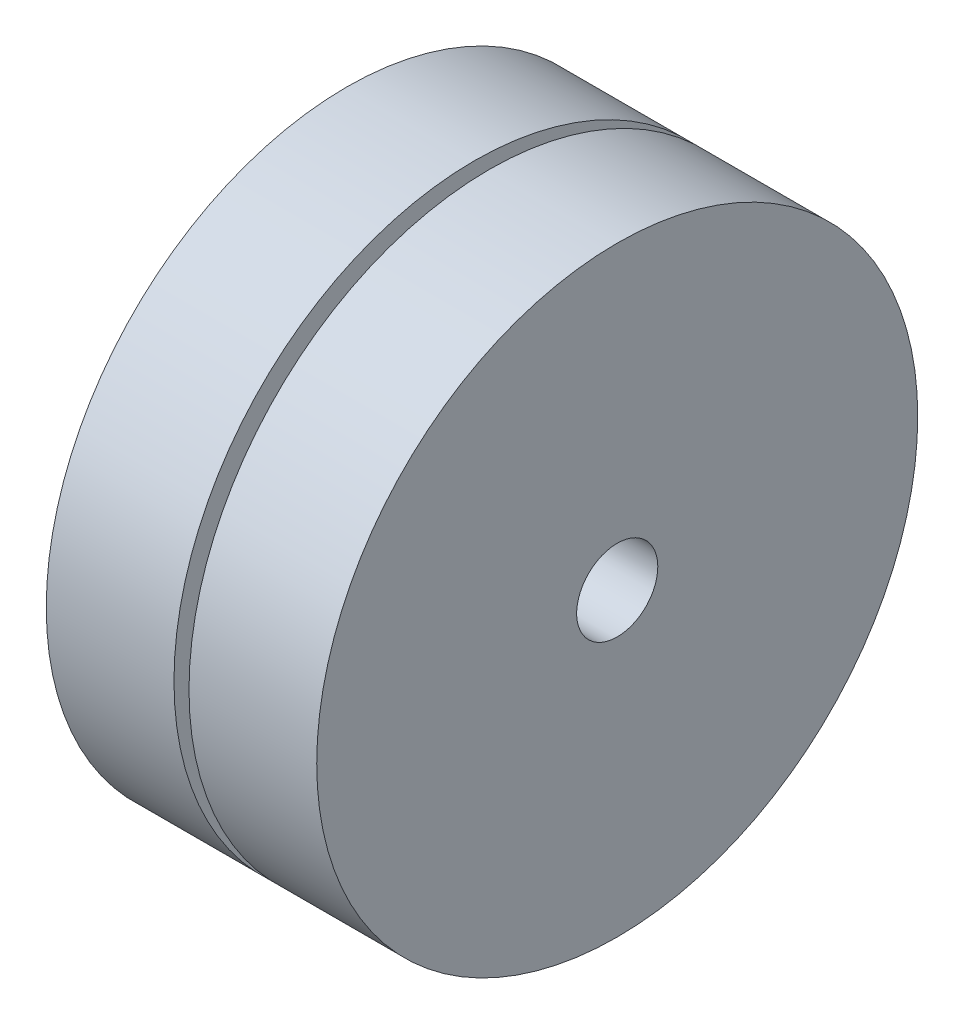
ISO-10303-21;
HEADER;
FILE_DESCRIPTION(('STEP AP214'),'2;1');
FILE_NAME('part.step','',(''),(''),'','','');
FILE_SCHEMA(('AUTOMOTIVE_DESIGN { 1 0 10303 214 1 1 1 1 }'));
ENDSEC;
DATA;
#1=APPLICATION_CONTEXT('core data for automotive mechanical design processes');
#2=APPLICATION_PROTOCOL_DEFINITION('international standard','automotive_design',2000,#1);
#3=PRODUCT_CONTEXT('',#1,'mechanical');
#4=PRODUCT('Part','Part','',(#3));
#5=PRODUCT_RELATED_PRODUCT_CATEGORY('part','',(#4));
#6=PRODUCT_DEFINITION_FORMATION('','',#4);
#7=PRODUCT_DEFINITION_CONTEXT('part definition',#1,'design');
#8=PRODUCT_DEFINITION('design','',#6,#7);
#9=PRODUCT_DEFINITION_SHAPE('','',#8);
#10=(LENGTH_UNIT() NAMED_UNIT(*) SI_UNIT(.MILLI.,.METRE.));
#11=(NAMED_UNIT(*) PLANE_ANGLE_UNIT() SI_UNIT($,.RADIAN.));
#12=(NAMED_UNIT(*) SI_UNIT($,.STERADIAN.) SOLID_ANGLE_UNIT());
#13=UNCERTAINTY_MEASURE_WITH_UNIT(LENGTH_MEASURE(1.E-05),#10,'distance_accuracy_value','');
#14=(GEOMETRIC_REPRESENTATION_CONTEXT(3) GLOBAL_UNCERTAINTY_ASSIGNED_CONTEXT((#13)) GLOBAL_UNIT_ASSIGNED_CONTEXT((#10,
#11,#12)) REPRESENTATION_CONTEXT('',''));
#15=CARTESIAN_POINT('',(0.,0.,0.));
#16=DIRECTION('',(0.,0.,1.));
#17=DIRECTION('',(1.,0.,0.));
#18=AXIS2_PLACEMENT_3D('',#15,#16,#17);
#19=CARTESIAN_POINT('',(18.,0.,0.));
#20=DIRECTION('',(-1.,0.,0.));
#21=DIRECTION('',(0.,0.,1.));
#22=AXIS2_PLACEMENT_3D('',#19,#20,#21);
#23=CYLINDRICAL_SURFACE('',#22,20.);
#24=CARTESIAN_POINT('',(18.,0.,0.));
#25=DIRECTION('',(1.,0.,0.));
#26=DIRECTION('',(0.,0.,-1.));
#27=AXIS2_PLACEMENT_3D('',#24,#25,#26);
#28=CIRCLE('',#27,20.);
#29=CARTESIAN_POINT('',(18.,0.,-20.));
#30=VERTEX_POINT('',#29);
#31=EDGE_CURVE('E10',#30,#30,#28,.T.);
#32=ORIENTED_EDGE('',*,*,#31,.F.);
#33=EDGE_LOOP('',(#32));
#34=FACE_BOUND('',#33,.T.);
#35=CARTESIAN_POINT('',(9.5,0.,0.));
#36=DIRECTION('',(-1.,0.,0.));
#37=DIRECTION('',(0.,0.,1.));
#38=AXIS2_PLACEMENT_3D('',#35,#36,#37);
#39=CIRCLE('',#38,20.);
#40=CARTESIAN_POINT('',(9.5,0.,20.));
#41=VERTEX_POINT('',#40);
#42=EDGE_CURVE('E34',#41,#41,#39,.T.);
#43=ORIENTED_EDGE('',*,*,#42,.F.);
#44=EDGE_LOOP('',(#43));
#45=FACE_BOUND('',#44,.T.);
#46=ADVANCED_FACE('F31',(#34,#45),#23,.T.);
#47=CARTESIAN_POINT('',(0.,0.,0.));
#48=DIRECTION('',(1.,0.,0.));
#49=DIRECTION('',(0.,0.,-1.));
#50=AXIS2_PLACEMENT_3D('',#47,#48,#49);
#51=CIRCLE('',#50,20.);
#52=CARTESIAN_POINT('',(0.,0.,-20.));
#53=VERTEX_POINT('',#52);
#54=EDGE_CURVE('E38',#53,#53,#51,.T.);
#55=ORIENTED_EDGE('',*,*,#54,.T.);
#56=EDGE_LOOP('',(#55));
#57=FACE_BOUND('',#56,.T.);
#58=CARTESIAN_POINT('',(8.5,0.,0.));
#59=DIRECTION('',(1.,0.,0.));
#60=DIRECTION('',(0.,0.,-1.));
#61=AXIS2_PLACEMENT_3D('',#58,#59,#60);
#62=CIRCLE('',#61,20.);
#63=CARTESIAN_POINT('',(8.5,0.,-20.));
#64=VERTEX_POINT('',#63);
#65=EDGE_CURVE('E48',#64,#64,#62,.T.);
#66=ORIENTED_EDGE('',*,*,#65,.F.);
#67=EDGE_LOOP('',(#66));
#68=FACE_BOUND('',#67,.T.);
#69=ADVANCED_FACE('F72',(#57,#68),#23,.T.);
#70=CARTESIAN_POINT('',(18.,0.,0.));
#71=DIRECTION('',(1.,0.,0.));
#72=DIRECTION('',(0.,0.,-1.));
#73=AXIS2_PLACEMENT_3D('',#70,#71,#72);
#74=PLANE('',#73);
#75=CARTESIAN_POINT('',(18.,0.,0.));
#76=DIRECTION('',(1.,0.,0.));
#77=DIRECTION('',(0.,0.,-1.));
#78=AXIS2_PLACEMENT_3D('',#75,#76,#77);
#79=CIRCLE('',#78,2.7);
#80=CARTESIAN_POINT('',(18.,0.,-2.7));
#81=VERTEX_POINT('',#80);
#82=EDGE_CURVE('E46',#81,#81,#79,.T.);
#83=ORIENTED_EDGE('',*,*,#82,.F.);
#84=EDGE_LOOP('',(#83));
#85=FACE_BOUND('',#84,.T.);
#86=ORIENTED_EDGE('',*,*,#31,.T.);
#87=EDGE_LOOP('',(#86));
#88=FACE_BOUND('',#87,.T.);
#89=ADVANCED_FACE('F69',(#85,#88),#74,.T.);
#90=CARTESIAN_POINT('',(0.,0.,0.));
#91=DIRECTION('',(1.,0.,0.));
#92=DIRECTION('',(0.,0.,-1.));
#93=AXIS2_PLACEMENT_3D('',#90,#91,#92);
#94=PLANE('',#93);
#95=CARTESIAN_POINT('',(0.,0.,0.));
#96=DIRECTION('',(1.,0.,0.));
#97=DIRECTION('',(0.,0.,-1.));
#98=AXIS2_PLACEMENT_3D('',#95,#96,#97);
#99=CIRCLE('',#98,2.7);
#100=CARTESIAN_POINT('',(0.,0.,-2.7));
#101=VERTEX_POINT('',#100);
#102=EDGE_CURVE('E43',#101,#101,#99,.T.);
#103=ORIENTED_EDGE('',*,*,#102,.T.);
#104=EDGE_LOOP('',(#103));
#105=FACE_BOUND('',#104,.T.);
#106=ORIENTED_EDGE('',*,*,#54,.F.);
#107=EDGE_LOOP('',(#106));
#108=FACE_BOUND('',#107,.T.);
#109=ADVANCED_FACE('F71',(#105,#108),#94,.F.);
#110=CARTESIAN_POINT('',(0.,0.,0.));
#111=DIRECTION('',(1.,0.,0.));
#112=DIRECTION('',(0.,0.,-1.));
#113=AXIS2_PLACEMENT_3D('',#110,#111,#112);
#114=CYLINDRICAL_SURFACE('',#113,2.7);
#115=ORIENTED_EDGE('',*,*,#102,.F.);
#116=EDGE_LOOP('',(#115));
#117=FACE_BOUND('',#116,.T.);
#118=ORIENTED_EDGE('',*,*,#82,.T.);
#119=EDGE_LOOP('',(#118));
#120=FACE_BOUND('',#119,.T.);
#121=ADVANCED_FACE('F67',(#117,#120),#114,.F.);
#122=CARTESIAN_POINT('',(9.5,12.332508329564,0.));
#123=DIRECTION('',(-1.,0.,0.));
#124=DIRECTION('',(0.,0.,1.));
#125=AXIS2_PLACEMENT_3D('',#122,#123,#124);
#126=PLANE('',#125);
#127=CARTESIAN_POINT('',(9.5,0.,0.));
#128=DIRECTION('',(-1.,0.,0.));
#129=DIRECTION('',(0.,0.,1.));
#130=AXIS2_PLACEMENT_3D('',#127,#128,#129);
#131=CIRCLE('',#130,12.332508329564);
#132=CARTESIAN_POINT('',(9.5,0.,12.332508329564));
#133=VERTEX_POINT('',#132);
#134=EDGE_CURVE('E50',#133,#133,#131,.T.);
#135=ORIENTED_EDGE('',*,*,#134,.F.);
#136=EDGE_LOOP('',(#135));
#137=FACE_BOUND('',#136,.T.);
#138=ORIENTED_EDGE('',*,*,#42,.T.);
#139=EDGE_LOOP('',(#138));
#140=FACE_BOUND('',#139,.T.);
#141=ADVANCED_FACE('F87',(#137,#140),#126,.T.);
#142=CARTESIAN_POINT('',(8.5,12.332508329564,0.));
#143=DIRECTION('',(1.,0.,0.));
#144=DIRECTION('',(0.,0.,-1.));
#145=AXIS2_PLACEMENT_3D('',#142,#143,#144);
#146=PLANE('',#145);
#147=CARTESIAN_POINT('',(8.5,0.,0.));
#148=DIRECTION('',(-1.,0.,0.));
#149=DIRECTION('',(0.,0.,1.));
#150=AXIS2_PLACEMENT_3D('',#147,#148,#149);
#151=CIRCLE('',#150,12.332508329564);
#152=CARTESIAN_POINT('',(8.5,0.,12.332508329564));
#153=VERTEX_POINT('',#152);
#154=EDGE_CURVE('E55',#153,#153,#151,.T.);
#155=ORIENTED_EDGE('',*,*,#154,.T.);
#156=EDGE_LOOP('',(#155));
#157=FACE_BOUND('',#156,.T.);
#158=ORIENTED_EDGE('',*,*,#65,.T.);
#159=EDGE_LOOP('',(#158));
#160=FACE_BOUND('',#159,.T.);
#161=ADVANCED_FACE('F89',(#157,#160),#146,.T.);
#162=CARTESIAN_POINT('',(9.,0.,0.));
#163=DIRECTION('',(-1.,0.,0.));
#164=DIRECTION('',(0.,0.,1.));
#165=AXIS2_PLACEMENT_3D('',#162,#163,#164);
#166=TOROIDAL_SURFACE('',#165,12.332508329564,0.5);
#167=ORIENTED_EDGE('',*,*,#134,.T.);
#168=EDGE_LOOP('',(#167));
#169=FACE_BOUND('',#168,.T.);
#170=ORIENTED_EDGE('',*,*,#154,.F.);
#171=EDGE_LOOP('',(#170));
#172=FACE_BOUND('',#171,.T.);
#173=ADVANCED_FACE('F96',(#169,#172),#166,.F.);
#174=CLOSED_SHELL('',(#46,#69,#89,#109,#121,#141,#161,#173));
#175=MANIFOLD_SOLID_BREP('B2',#174);
#176=ADVANCED_BREP_SHAPE_REPRESENTATION('',(#18,#175),#14);
#177=SHAPE_DEFINITION_REPRESENTATION(#9,#176);
ENDSEC;
END-ISO-10303-21;
